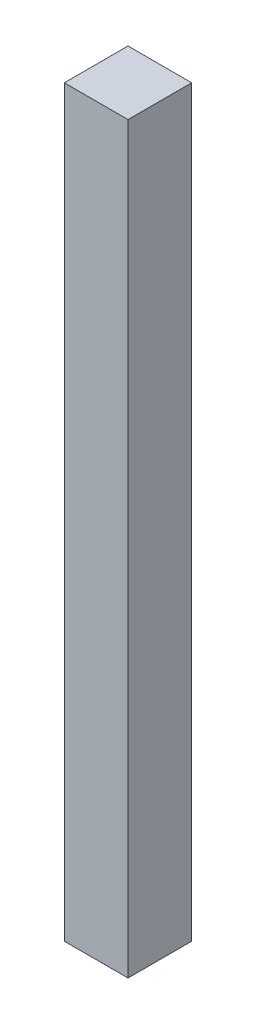
ISO-10303-21;
HEADER;
FILE_DESCRIPTION(('STEP AP214'),'2;1');
FILE_NAME('part.step','',(''),(''),'','','');
FILE_SCHEMA(('AUTOMOTIVE_DESIGN { 1 0 10303 214 1 1 1 1 }'));
ENDSEC;
DATA;
#1=APPLICATION_CONTEXT('core data for automotive mechanical design processes');
#2=APPLICATION_PROTOCOL_DEFINITION('international standard','automotive_design',2000,#1);
#3=PRODUCT_CONTEXT('',#1,'mechanical');
#4=PRODUCT('Part','Part','',(#3));
#5=PRODUCT_RELATED_PRODUCT_CATEGORY('part','',(#4));
#6=PRODUCT_DEFINITION_FORMATION('','',#4);
#7=PRODUCT_DEFINITION_CONTEXT('part definition',#1,'design');
#8=PRODUCT_DEFINITION('design','',#6,#7);
#9=PRODUCT_DEFINITION_SHAPE('','',#8);
#10=(LENGTH_UNIT() NAMED_UNIT(*) SI_UNIT(.MILLI.,.METRE.));
#11=(NAMED_UNIT(*) PLANE_ANGLE_UNIT() SI_UNIT($,.RADIAN.));
#12=(NAMED_UNIT(*) SI_UNIT($,.STERADIAN.) SOLID_ANGLE_UNIT());
#13=UNCERTAINTY_MEASURE_WITH_UNIT(LENGTH_MEASURE(1.E-05),#10,'distance_accuracy_value','');
#14=(GEOMETRIC_REPRESENTATION_CONTEXT(3) GLOBAL_UNCERTAINTY_ASSIGNED_CONTEXT((#13)) GLOBAL_UNIT_ASSIGNED_CONTEXT((#10,
#11,#12)) REPRESENTATION_CONTEXT('',''));
#15=CARTESIAN_POINT('',(0.,0.,0.));
#16=DIRECTION('',(0.,0.,1.));
#17=DIRECTION('',(1.,0.,0.));
#18=AXIS2_PLACEMENT_3D('',#15,#16,#17);
#19=CARTESIAN_POINT('',(-88.9268586588029,-700.,53.2337387842834));
#20=DIRECTION('',(-1.,0.,0.));
#21=DIRECTION('',(0.,0.,1.));
#22=AXIS2_PLACEMENT_3D('',#19,#20,#21);
#23=PLANE('',#22);
#24=DIRECTION('',(0.,0.,1.));
#25=VECTOR('',#24,1.);
#26=CARTESIAN_POINT('',(-88.9268586588029,0.,53.2337387842834));
#27=LINE('',#26,#25);
#28=CARTESIAN_POINT('',(-88.9268586588029,0.,-6.76626121571661));
#29=VERTEX_POINT('',#28);
#30=CARTESIAN_POINT('',(-88.9268586588029,0.,53.2337387842834));
#31=VERTEX_POINT('',#30);
#32=EDGE_CURVE('E109',#29,#31,#27,.T.);
#33=ORIENTED_EDGE('',*,*,#32,.F.);
#34=DIRECTION('',(0.,1.,0.));
#35=VECTOR('',#34,1.);
#36=CARTESIAN_POINT('',(-88.9268586588029,-700.,-6.76626121571661));
#37=LINE('',#36,#35);
#38=CARTESIAN_POINT('',(-88.9268586588029,-700.,-6.76626121571661));
#39=VERTEX_POINT('',#38);
#40=EDGE_CURVE('E11',#39,#29,#37,.T.);
#41=ORIENTED_EDGE('',*,*,#40,.F.);
#42=DIRECTION('',(0.,0.,1.));
#43=VECTOR('',#42,1.);
#44=CARTESIAN_POINT('',(-88.9268586588029,-700.,53.2337387842834));
#45=LINE('',#44,#43);
#46=CARTESIAN_POINT('',(-88.9268586588029,-700.,53.2337387842834));
#47=VERTEX_POINT('',#46);
#48=EDGE_CURVE('E101',#39,#47,#45,.T.);
#49=ORIENTED_EDGE('',*,*,#48,.T.);
#50=DIRECTION('',(0.,1.,0.));
#51=VECTOR('',#50,1.);
#52=CARTESIAN_POINT('',(-88.9268586588029,-700.,53.2337387842834));
#53=LINE('',#52,#51);
#54=EDGE_CURVE('E42',#47,#31,#53,.T.);
#55=ORIENTED_EDGE('',*,*,#54,.T.);
#56=EDGE_LOOP('',(#33,#41,#49,#55));
#57=FACE_BOUND('',#56,.T.);
#58=ADVANCED_FACE('F39',(#57),#23,.T.);
#59=CARTESIAN_POINT('',(-88.9268586588029,-700.,-6.76626121571661));
#60=DIRECTION('',(0.,0.,-1.));
#61=DIRECTION('',(-1.,0.,0.));
#62=AXIS2_PLACEMENT_3D('',#59,#60,#61);
#63=PLANE('',#62);
#64=DIRECTION('',(-1.,0.,0.));
#65=VECTOR('',#64,1.);
#66=CARTESIAN_POINT('',(-88.9268586588029,0.,-6.76626121571661));
#67=LINE('',#66,#65);
#68=CARTESIAN_POINT('',(-28.9268586588029,0.,-6.76626121571661));
#69=VERTEX_POINT('',#68);
#70=EDGE_CURVE('E104',#69,#29,#67,.T.);
#71=ORIENTED_EDGE('',*,*,#70,.F.);
#72=DIRECTION('',(0.,1.,0.));
#73=VECTOR('',#72,1.);
#74=CARTESIAN_POINT('',(-28.9268586588029,-700.,-6.76626121571661));
#75=LINE('',#74,#73);
#76=CARTESIAN_POINT('',(-28.9268586588029,-700.,-6.76626121571661));
#77=VERTEX_POINT('',#76);
#78=EDGE_CURVE('E49',#77,#69,#75,.T.);
#79=ORIENTED_EDGE('',*,*,#78,.F.);
#80=DIRECTION('',(-1.,0.,0.));
#81=VECTOR('',#80,1.);
#82=CARTESIAN_POINT('',(-88.9268586588029,-700.,-6.76626121571661));
#83=LINE('',#82,#81);
#84=EDGE_CURVE('E96',#77,#39,#83,.T.);
#85=ORIENTED_EDGE('',*,*,#84,.T.);
#86=ORIENTED_EDGE('',*,*,#40,.T.);
#87=EDGE_LOOP('',(#71,#79,#85,#86));
#88=FACE_BOUND('',#87,.T.);
#89=ADVANCED_FACE('F125',(#88),#63,.T.);
#90=CARTESIAN_POINT('',(-28.9268586588029,-700.,53.2337387842834));
#91=DIRECTION('',(1.,0.,0.));
#92=DIRECTION('',(0.,0.,-1.));
#93=AXIS2_PLACEMENT_3D('',#90,#91,#92);
#94=PLANE('',#93);
#95=DIRECTION('',(0.,0.,-1.));
#96=VECTOR('',#95,1.);
#97=CARTESIAN_POINT('',(-28.9268586588029,0.,53.2337387842834));
#98=LINE('',#97,#96);
#99=CARTESIAN_POINT('',(-28.9268586588029,0.,53.2337387842834));
#100=VERTEX_POINT('',#99);
#101=EDGE_CURVE('E90',#100,#69,#98,.T.);
#102=ORIENTED_EDGE('',*,*,#101,.F.);
#103=DIRECTION('',(0.,1.,0.));
#104=VECTOR('',#103,1.);
#105=CARTESIAN_POINT('',(-28.9268586588029,-700.,53.2337387842834));
#106=LINE('',#105,#104);
#107=CARTESIAN_POINT('',(-28.9268586588029,-700.,53.2337387842834));
#108=VERTEX_POINT('',#107);
#109=EDGE_CURVE('E85',#108,#100,#106,.T.);
#110=ORIENTED_EDGE('',*,*,#109,.F.);
#111=DIRECTION('',(0.,0.,-1.));
#112=VECTOR('',#111,1.);
#113=CARTESIAN_POINT('',(-28.9268586588029,-700.,53.2337387842834));
#114=LINE('',#113,#112);
#115=EDGE_CURVE('E88',#108,#77,#114,.T.);
#116=ORIENTED_EDGE('',*,*,#115,.T.);
#117=ORIENTED_EDGE('',*,*,#78,.T.);
#118=EDGE_LOOP('',(#102,#110,#116,#117));
#119=FACE_BOUND('',#118,.T.);
#120=ADVANCED_FACE('F87',(#119),#94,.T.);
#121=CARTESIAN_POINT('',(-88.9268586588029,-700.,53.2337387842834));
#122=DIRECTION('',(0.,0.,1.));
#123=DIRECTION('',(1.,0.,0.));
#124=AXIS2_PLACEMENT_3D('',#121,#122,#123);
#125=PLANE('',#124);
#126=DIRECTION('',(1.,0.,0.));
#127=VECTOR('',#126,1.);
#128=CARTESIAN_POINT('',(-88.9268586588029,0.,53.2337387842834));
#129=LINE('',#128,#127);
#130=EDGE_CURVE('E113',#31,#100,#129,.T.);
#131=ORIENTED_EDGE('',*,*,#130,.F.);
#132=ORIENTED_EDGE('',*,*,#54,.F.);
#133=DIRECTION('',(1.,0.,0.));
#134=VECTOR('',#133,1.);
#135=CARTESIAN_POINT('',(-88.9268586588029,-700.,53.2337387842834));
#136=LINE('',#135,#134);
#137=EDGE_CURVE('E95',#47,#108,#136,.T.);
#138=ORIENTED_EDGE('',*,*,#137,.T.);
#139=ORIENTED_EDGE('',*,*,#109,.T.);
#140=EDGE_LOOP('',(#131,#132,#138,#139));
#141=FACE_BOUND('',#140,.T.);
#142=ADVANCED_FACE('F99',(#141),#125,.T.);
#143=CARTESIAN_POINT('',(0.,-700.,0.));
#144=DIRECTION('',(0.,-1.,0.));
#145=DIRECTION('',(0.,0.,-1.));
#146=AXIS2_PLACEMENT_3D('',#143,#144,#145);
#147=PLANE('',#146);
#148=ORIENTED_EDGE('',*,*,#48,.F.);
#149=ORIENTED_EDGE('',*,*,#84,.F.);
#150=ORIENTED_EDGE('',*,*,#115,.F.);
#151=ORIENTED_EDGE('',*,*,#137,.F.);
#152=EDGE_LOOP('',(#148,#149,#150,#151));
#153=FACE_BOUND('',#152,.T.);
#154=ADVANCED_FACE('F94',(#153),#147,.T.);
#155=CARTESIAN_POINT('',(0.,0.,0.));
#156=DIRECTION('',(0.,-1.,0.));
#157=DIRECTION('',(0.,0.,-1.));
#158=AXIS2_PLACEMENT_3D('',#155,#156,#157);
#159=PLANE('',#158);
#160=ORIENTED_EDGE('',*,*,#32,.T.);
#161=ORIENTED_EDGE('',*,*,#130,.T.);
#162=ORIENTED_EDGE('',*,*,#101,.T.);
#163=ORIENTED_EDGE('',*,*,#70,.T.);
#164=EDGE_LOOP('',(#160,#161,#162,#163));
#165=FACE_BOUND('',#164,.T.);
#166=ADVANCED_FACE('F124',(#165),#159,.F.);
#167=CLOSED_SHELL('',(#58,#89,#120,#142,#154,#166));
#168=MANIFOLD_SOLID_BREP('B2',#167);
#169=ADVANCED_BREP_SHAPE_REPRESENTATION('',(#18,#168),#14);
#170=SHAPE_DEFINITION_REPRESENTATION(#9,#169);
ENDSEC;
END-ISO-10303-21;
